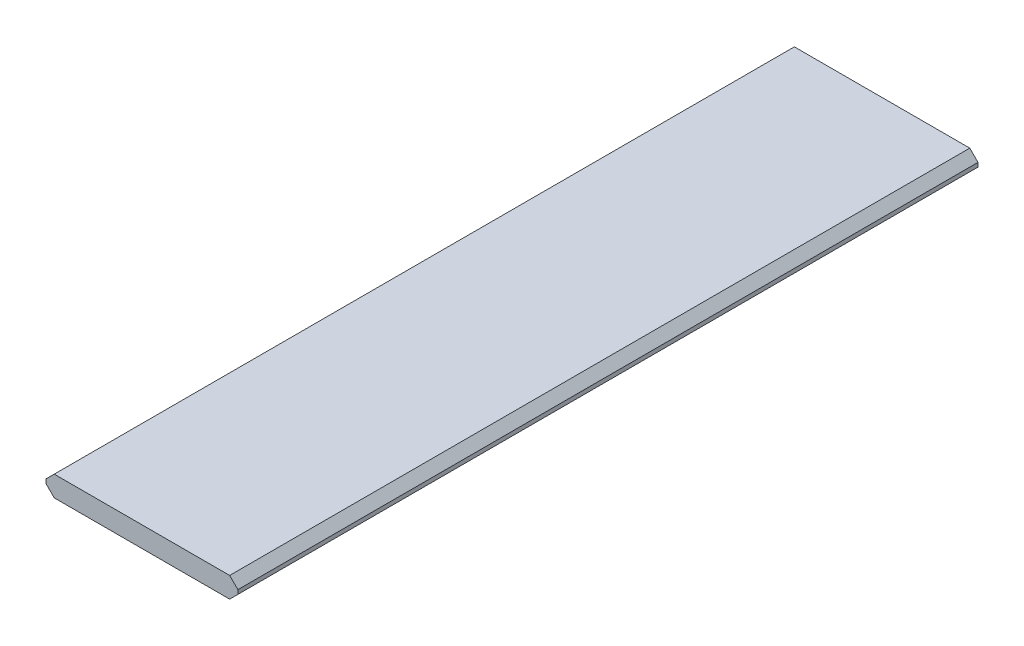
ISO-10303-21;
HEADER;
FILE_DESCRIPTION(('STEP AP214'),'2;1');
FILE_NAME('part.step','',(''),(''),'','','');
FILE_SCHEMA(('AUTOMOTIVE_DESIGN { 1 0 10303 214 1 1 1 1 }'));
ENDSEC;
DATA;
#1=APPLICATION_CONTEXT('core data for automotive mechanical design processes');
#2=APPLICATION_PROTOCOL_DEFINITION('international standard','automotive_design',2000,#1);
#3=PRODUCT_CONTEXT('',#1,'mechanical');
#4=PRODUCT('Part','Part','',(#3));
#5=PRODUCT_RELATED_PRODUCT_CATEGORY('part','',(#4));
#6=PRODUCT_DEFINITION_FORMATION('','',#4);
#7=PRODUCT_DEFINITION_CONTEXT('part definition',#1,'design');
#8=PRODUCT_DEFINITION('design','',#6,#7);
#9=PRODUCT_DEFINITION_SHAPE('','',#8);
#10=(LENGTH_UNIT() NAMED_UNIT(*) SI_UNIT(.MILLI.,.METRE.));
#11=(NAMED_UNIT(*) PLANE_ANGLE_UNIT() SI_UNIT($,.RADIAN.));
#12=(NAMED_UNIT(*) SI_UNIT($,.STERADIAN.) SOLID_ANGLE_UNIT());
#13=UNCERTAINTY_MEASURE_WITH_UNIT(LENGTH_MEASURE(1.E-05),#10,'distance_accuracy_value','');
#14=(GEOMETRIC_REPRESENTATION_CONTEXT(3) GLOBAL_UNCERTAINTY_ASSIGNED_CONTEXT((#13)) GLOBAL_UNIT_ASSIGNED_CONTEXT((#10,
#11,#12)) REPRESENTATION_CONTEXT('',''));
#15=CARTESIAN_POINT('',(0.,0.,0.));
#16=DIRECTION('',(0.,0.,1.));
#17=DIRECTION('',(1.,0.,0.));
#18=AXIS2_PLACEMENT_3D('',#15,#16,#17);
#19=CARTESIAN_POINT('',(88.8999999999999,19.05,-342.9));
#20=DIRECTION('',(-1.,0.,0.));
#21=DIRECTION('',(0.,0.,1.));
#22=AXIS2_PLACEMENT_3D('',#19,#20,#21);
#23=PLANE('',#22);
#24=DIRECTION('',(0.,-1.,0.));
#25=VECTOR('',#24,1.);
#26=CARTESIAN_POINT('',(88.9,19.05,342.9));
#27=LINE('',#26,#25);
#28=CARTESIAN_POINT('',(88.9,11.43,342.9));
#29=VERTEX_POINT('',#28);
#30=CARTESIAN_POINT('',(88.9,7.61999999999996,342.9));
#31=VERTEX_POINT('',#30);
#32=EDGE_CURVE('E121',#29,#31,#27,.T.);
#33=ORIENTED_EDGE('',*,*,#32,.T.);
#34=DIRECTION('',(0.,0.,-1.));
#35=VECTOR('',#34,1.);
#36=CARTESIAN_POINT('',(88.8999999999999,7.61999999999996,-342.9));
#37=LINE('',#36,#35);
#38=CARTESIAN_POINT('',(88.8999999999999,7.61999999999996,-342.9));
#39=VERTEX_POINT('',#38);
#40=EDGE_CURVE('E11',#31,#39,#37,.T.);
#41=ORIENTED_EDGE('',*,*,#40,.T.);
#42=DIRECTION('',(0.,-1.,0.));
#43=VECTOR('',#42,1.);
#44=CARTESIAN_POINT('',(88.8999999999999,19.05,-342.9));
#45=LINE('',#44,#43);
#46=CARTESIAN_POINT('',(88.8999999999999,11.43,-342.9));
#47=VERTEX_POINT('',#46);
#48=EDGE_CURVE('E113',#47,#39,#45,.T.);
#49=ORIENTED_EDGE('',*,*,#48,.F.);
#50=DIRECTION('',(0.,0.,1.));
#51=VECTOR('',#50,1.);
#52=CARTESIAN_POINT('',(88.9,11.43,342.9));
#53=LINE('',#52,#51);
#54=EDGE_CURVE('E40',#47,#29,#53,.T.);
#55=ORIENTED_EDGE('',*,*,#54,.T.);
#56=EDGE_LOOP('',(#33,#41,#49,#55));
#57=FACE_BOUND('',#56,.T.);
#58=ADVANCED_FACE('F32',(#57),#23,.F.);
#59=CARTESIAN_POINT('',(-88.9,19.05,-342.9));
#60=DIRECTION('',(0.,0.,1.));
#61=DIRECTION('',(1.,0.,0.));
#62=AXIS2_PLACEMENT_3D('',#59,#60,#61);
#63=PLANE('',#62);
#64=DIRECTION('',(0.,-1.,0.));
#65=VECTOR('',#64,1.);
#66=CARTESIAN_POINT('',(-88.9,19.05,-342.9));
#67=LINE('',#66,#65);
#68=CARTESIAN_POINT('',(-88.9,11.43,-342.9));
#69=VERTEX_POINT('',#68);
#70=CARTESIAN_POINT('',(-88.9,7.61999999999996,-342.9));
#71=VERTEX_POINT('',#70);
#72=EDGE_CURVE('E134',#69,#71,#67,.T.);
#73=ORIENTED_EDGE('',*,*,#72,.F.);
#74=DIRECTION('',(0.707106781186548,0.707106781186548,0.));
#75=VECTOR('',#74,1.);
#76=CARTESIAN_POINT('',(-81.28,19.05,-342.9));
#77=LINE('',#76,#75);
#78=CARTESIAN_POINT('',(-81.2800000000001,19.05,-342.9));
#79=VERTEX_POINT('',#78);
#80=EDGE_CURVE('E118',#69,#79,#77,.T.);
#81=ORIENTED_EDGE('',*,*,#80,.T.);
#82=DIRECTION('',(-1.,0.,0.));
#83=VECTOR('',#82,1.);
#84=CARTESIAN_POINT('',(-88.9,19.05,-342.9));
#85=LINE('',#84,#83);
#86=CARTESIAN_POINT('',(81.2799999999999,19.05,-342.9));
#87=VERTEX_POINT('',#86);
#88=EDGE_CURVE('E108',#87,#79,#85,.T.);
#89=ORIENTED_EDGE('',*,*,#88,.F.);
#90=DIRECTION('',(0.707106781186548,-0.707106781186548,0.));
#91=VECTOR('',#90,1.);
#92=CARTESIAN_POINT('',(81.28,19.05,-342.9));
#93=LINE('',#92,#91);
#94=EDGE_CURVE('E54',#87,#47,#93,.T.);
#95=ORIENTED_EDGE('',*,*,#94,.T.);
#96=ORIENTED_EDGE('',*,*,#48,.T.);
#97=DIRECTION('',(0.707106781186548,0.707106781186548,0.));
#98=VECTOR('',#97,1.);
#99=CARTESIAN_POINT('',(88.8999999999999,7.61999999999996,-342.9));
#100=LINE('',#99,#98);
#101=CARTESIAN_POINT('',(81.28,0.,-342.9));
#102=VERTEX_POINT('',#101);
#103=EDGE_CURVE('E47',#39,#102,#100,.F.);
#104=ORIENTED_EDGE('',*,*,#103,.T.);
#105=DIRECTION('',(-1.,0.,0.));
#106=VECTOR('',#105,1.);
#107=CARTESIAN_POINT('',(-88.9,0.,-342.9));
#108=LINE('',#107,#106);
#109=CARTESIAN_POINT('',(-81.2800000000001,0.,-342.9));
#110=VERTEX_POINT('',#109);
#111=EDGE_CURVE('E124',#102,#110,#108,.T.);
#112=ORIENTED_EDGE('',*,*,#111,.T.);
#113=DIRECTION('',(0.707106781186548,-0.707106781186548,0.));
#114=VECTOR('',#113,1.);
#115=CARTESIAN_POINT('',(-88.9,7.61999999999996,-342.9));
#116=LINE('',#115,#114);
#117=EDGE_CURVE('E152',#110,#71,#116,.F.);
#118=ORIENTED_EDGE('',*,*,#117,.T.);
#119=EDGE_LOOP('',(#73,#81,#89,#95,#96,#104,#112,#118));
#120=FACE_BOUND('',#119,.T.);
#121=ADVANCED_FACE('F116',(#120),#63,.F.);
#122=CARTESIAN_POINT('',(-88.9,19.05,-342.9));
#123=DIRECTION('',(1.,0.,0.));
#124=DIRECTION('',(0.,0.,-1.));
#125=AXIS2_PLACEMENT_3D('',#122,#123,#124);
#126=PLANE('',#125);
#127=DIRECTION('',(0.,-1.,0.));
#128=VECTOR('',#127,1.);
#129=CARTESIAN_POINT('',(-88.8999999999999,19.05,342.9));
#130=LINE('',#129,#128);
#131=CARTESIAN_POINT('',(-88.8999999999999,11.43,342.9));
#132=VERTEX_POINT('',#131);
#133=CARTESIAN_POINT('',(-88.8999999999999,7.61999999999996,342.9));
#134=VERTEX_POINT('',#133);
#135=EDGE_CURVE('E131',#132,#134,#130,.T.);
#136=ORIENTED_EDGE('',*,*,#135,.F.);
#137=DIRECTION('',(0.,0.,-1.));
#138=VECTOR('',#137,1.);
#139=CARTESIAN_POINT('',(-88.9,11.43,-342.9));
#140=LINE('',#139,#138);
#141=EDGE_CURVE('E101',#132,#69,#140,.T.);
#142=ORIENTED_EDGE('',*,*,#141,.T.);
#143=ORIENTED_EDGE('',*,*,#72,.T.);
#144=DIRECTION('',(0.,0.,1.));
#145=VECTOR('',#144,1.);
#146=CARTESIAN_POINT('',(-88.9,7.61999999999996,-342.9));
#147=LINE('',#146,#145);
#148=EDGE_CURVE('E147',#71,#134,#147,.T.);
#149=ORIENTED_EDGE('',*,*,#148,.T.);
#150=EDGE_LOOP('',(#136,#142,#143,#149));
#151=FACE_BOUND('',#150,.T.);
#152=ADVANCED_FACE('F175',(#151),#126,.F.);
#153=CARTESIAN_POINT('',(-88.8999999999999,19.05,342.9));
#154=DIRECTION('',(0.,0.,-1.));
#155=DIRECTION('',(-1.,0.,0.));
#156=AXIS2_PLACEMENT_3D('',#153,#154,#155);
#157=PLANE('',#156);
#158=DIRECTION('',(1.,0.,0.));
#159=VECTOR('',#158,1.);
#160=CARTESIAN_POINT('',(-88.8999999999999,19.05,342.9));
#161=LINE('',#160,#159);
#162=CARTESIAN_POINT('',(-81.28,19.05,342.9));
#163=VERTEX_POINT('',#162);
#164=CARTESIAN_POINT('',(81.28,19.05,342.9));
#165=VERTEX_POINT('',#164);
#166=EDGE_CURVE('E111',#163,#165,#161,.T.);
#167=ORIENTED_EDGE('',*,*,#166,.F.);
#168=DIRECTION('',(-0.707106781186548,-0.707106781186548,0.));
#169=VECTOR('',#168,1.);
#170=CARTESIAN_POINT('',(-81.28,19.05,342.9));
#171=LINE('',#170,#169);
#172=EDGE_CURVE('E145',#163,#132,#171,.T.);
#173=ORIENTED_EDGE('',*,*,#172,.T.);
#174=ORIENTED_EDGE('',*,*,#135,.T.);
#175=DIRECTION('',(-0.707106781186548,0.707106781186548,0.));
#176=VECTOR('',#175,1.);
#177=CARTESIAN_POINT('',(-88.9,7.62,342.9));
#178=LINE('',#177,#176);
#179=CARTESIAN_POINT('',(-81.28,0.,342.9));
#180=VERTEX_POINT('',#179);
#181=EDGE_CURVE('E143',#134,#180,#178,.F.);
#182=ORIENTED_EDGE('',*,*,#181,.T.);
#183=DIRECTION('',(1.,0.,0.));
#184=VECTOR('',#183,1.);
#185=CARTESIAN_POINT('',(-88.8999999999999,0.,342.9));
#186=LINE('',#185,#184);
#187=CARTESIAN_POINT('',(81.28,0.,342.9));
#188=VERTEX_POINT('',#187);
#189=EDGE_CURVE('E119',#180,#188,#186,.T.);
#190=ORIENTED_EDGE('',*,*,#189,.T.);
#191=DIRECTION('',(-0.707106781186548,-0.707106781186548,0.));
#192=VECTOR('',#191,1.);
#193=CARTESIAN_POINT('',(88.9,7.61999999999992,342.9));
#194=LINE('',#193,#192);
#195=EDGE_CURVE('E141',#188,#31,#194,.F.);
#196=ORIENTED_EDGE('',*,*,#195,.T.);
#197=ORIENTED_EDGE('',*,*,#32,.F.);
#198=DIRECTION('',(-0.707106781186548,0.707106781186548,0.));
#199=VECTOR('',#198,1.);
#200=CARTESIAN_POINT('',(81.2800000000001,19.05,342.9));
#201=LINE('',#200,#199);
#202=EDGE_CURVE('E139',#29,#165,#201,.T.);
#203=ORIENTED_EDGE('',*,*,#202,.T.);
#204=EDGE_LOOP('',(#167,#173,#174,#182,#190,#196,#197,#203));
#205=FACE_BOUND('',#204,.T.);
#206=ADVANCED_FACE('F161',(#205),#157,.F.);
#207=CARTESIAN_POINT('',(88.9,19.05,342.9));
#208=DIRECTION('',(0.,1.,0.));
#209=DIRECTION('',(0.,0.,1.));
#210=AXIS2_PLACEMENT_3D('',#207,#208,#209);
#211=PLANE('',#210);
#212=ORIENTED_EDGE('',*,*,#88,.T.);
#213=DIRECTION('',(0.,0.,1.));
#214=VECTOR('',#213,1.);
#215=CARTESIAN_POINT('',(-81.28,19.05,342.9));
#216=LINE('',#215,#214);
#217=EDGE_CURVE('E112',#79,#163,#216,.T.);
#218=ORIENTED_EDGE('',*,*,#217,.T.);
#219=ORIENTED_EDGE('',*,*,#166,.T.);
#220=DIRECTION('',(0.,0.,-1.));
#221=VECTOR('',#220,1.);
#222=CARTESIAN_POINT('',(81.28,19.05,-342.9));
#223=LINE('',#222,#221);
#224=EDGE_CURVE('E100',#165,#87,#223,.T.);
#225=ORIENTED_EDGE('',*,*,#224,.T.);
#226=EDGE_LOOP('',(#212,#218,#219,#225));
#227=FACE_BOUND('',#226,.T.);
#228=ADVANCED_FACE('F106',(#227),#211,.T.);
#229=CARTESIAN_POINT('',(88.9,0.,342.9));
#230=DIRECTION('',(0.,1.,0.));
#231=DIRECTION('',(0.,0.,1.));
#232=AXIS2_PLACEMENT_3D('',#229,#230,#231);
#233=PLANE('',#232);
#234=ORIENTED_EDGE('',*,*,#189,.F.);
#235=DIRECTION('',(0.,0.,-1.));
#236=VECTOR('',#235,1.);
#237=CARTESIAN_POINT('',(-81.28,0.,342.9));
#238=LINE('',#237,#236);
#239=EDGE_CURVE('E157',#180,#110,#238,.T.);
#240=ORIENTED_EDGE('',*,*,#239,.T.);
#241=ORIENTED_EDGE('',*,*,#111,.F.);
#242=DIRECTION('',(0.,0.,1.));
#243=VECTOR('',#242,1.);
#244=CARTESIAN_POINT('',(81.2800000000001,0.,342.9));
#245=LINE('',#244,#243);
#246=EDGE_CURVE('E155',#102,#188,#245,.T.);
#247=ORIENTED_EDGE('',*,*,#246,.T.);
#248=EDGE_LOOP('',(#234,#240,#241,#247));
#249=FACE_BOUND('',#248,.T.);
#250=ADVANCED_FACE('F168',(#249),#233,.F.);
#251=CARTESIAN_POINT('',(-81.28,19.05,342.9));
#252=DIRECTION('',(-0.707106781186548,0.707106781186548,0.));
#253=DIRECTION('',(-0.707106781186548,-0.707106781186548,0.));
#254=AXIS2_PLACEMENT_3D('',#251,#252,#253);
#255=PLANE('',#254);
#256=ORIENTED_EDGE('',*,*,#80,.F.);
#257=ORIENTED_EDGE('',*,*,#141,.F.);
#258=ORIENTED_EDGE('',*,*,#172,.F.);
#259=ORIENTED_EDGE('',*,*,#217,.F.);
#260=EDGE_LOOP('',(#256,#257,#258,#259));
#261=FACE_BOUND('',#260,.T.);
#262=ADVANCED_FACE('F178',(#261),#255,.T.);
#263=CARTESIAN_POINT('',(-88.9,7.61999999999996,-342.9));
#264=DIRECTION('',(0.707106781186548,0.707106781186548,0.));
#265=DIRECTION('',(-0.707106781186548,0.707106781186548,0.));
#266=AXIS2_PLACEMENT_3D('',#263,#264,#265);
#267=PLANE('',#266);
#268=ORIENTED_EDGE('',*,*,#117,.F.);
#269=ORIENTED_EDGE('',*,*,#239,.F.);
#270=ORIENTED_EDGE('',*,*,#181,.F.);
#271=ORIENTED_EDGE('',*,*,#148,.F.);
#272=EDGE_LOOP('',(#268,#269,#270,#271));
#273=FACE_BOUND('',#272,.T.);
#274=ADVANCED_FACE('F171',(#273),#267,.F.);
#275=CARTESIAN_POINT('',(88.8999999999999,7.61999999999996,-342.9));
#276=DIRECTION('',(-0.707106781186548,0.707106781186548,0.));
#277=DIRECTION('',(-0.707106781186548,-0.707106781186548,0.));
#278=AXIS2_PLACEMENT_3D('',#275,#276,#277);
#279=PLANE('',#278);
#280=ORIENTED_EDGE('',*,*,#195,.F.);
#281=ORIENTED_EDGE('',*,*,#246,.F.);
#282=ORIENTED_EDGE('',*,*,#103,.F.);
#283=ORIENTED_EDGE('',*,*,#40,.F.);
#284=EDGE_LOOP('',(#280,#281,#282,#283));
#285=FACE_BOUND('',#284,.T.);
#286=ADVANCED_FACE('F164',(#285),#279,.F.);
#287=CARTESIAN_POINT('',(81.2800000000001,19.05,342.9));
#288=DIRECTION('',(0.707106781186548,0.707106781186548,0.));
#289=DIRECTION('',(-0.707106781186548,0.707106781186548,0.));
#290=AXIS2_PLACEMENT_3D('',#287,#288,#289);
#291=PLANE('',#290);
#292=ORIENTED_EDGE('',*,*,#202,.F.);
#293=ORIENTED_EDGE('',*,*,#54,.F.);
#294=ORIENTED_EDGE('',*,*,#94,.F.);
#295=ORIENTED_EDGE('',*,*,#224,.F.);
#296=EDGE_LOOP('',(#292,#293,#294,#295));
#297=FACE_BOUND('',#296,.T.);
#298=ADVANCED_FACE('F34',(#297),#291,.T.);
#299=CLOSED_SHELL('',(#58,#121,#152,#206,#228,#250,#262,#274,#286,#298));
#300=MANIFOLD_SOLID_BREP('B2',#299);
#301=ADVANCED_BREP_SHAPE_REPRESENTATION('',(#18,#300),#14);
#302=SHAPE_DEFINITION_REPRESENTATION(#9,#301);
ENDSEC;
END-ISO-10303-21;
